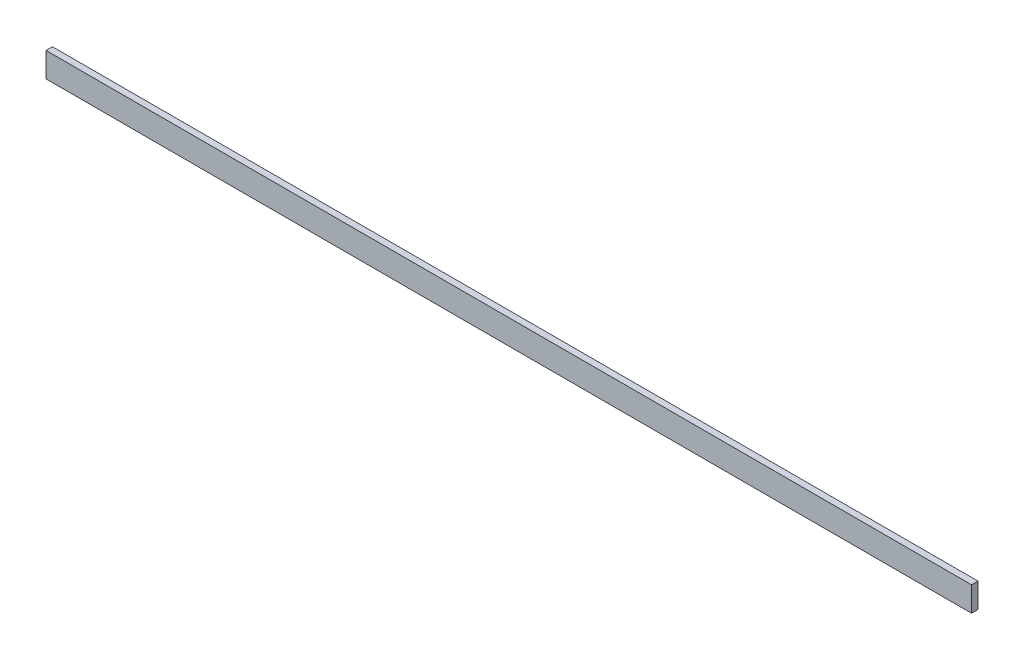
ISO-10303-21;
HEADER;
FILE_DESCRIPTION(('STEP AP214'),'2;1');
FILE_NAME('part.step','',(''),(''),'','','');
FILE_SCHEMA(('AUTOMOTIVE_DESIGN { 1 0 10303 214 1 1 1 1 }'));
ENDSEC;
DATA;
#1=APPLICATION_CONTEXT('core data for automotive mechanical design processes');
#2=APPLICATION_PROTOCOL_DEFINITION('international standard','automotive_design',2000,#1);
#3=PRODUCT_CONTEXT('',#1,'mechanical');
#4=PRODUCT('Part','Part','',(#3));
#5=PRODUCT_RELATED_PRODUCT_CATEGORY('part','',(#4));
#6=PRODUCT_DEFINITION_FORMATION('','',#4);
#7=PRODUCT_DEFINITION_CONTEXT('part definition',#1,'design');
#8=PRODUCT_DEFINITION('design','',#6,#7);
#9=PRODUCT_DEFINITION_SHAPE('','',#8);
#10=(LENGTH_UNIT() NAMED_UNIT(*) SI_UNIT(.MILLI.,.METRE.));
#11=(NAMED_UNIT(*) PLANE_ANGLE_UNIT() SI_UNIT($,.RADIAN.));
#12=(NAMED_UNIT(*) SI_UNIT($,.STERADIAN.) SOLID_ANGLE_UNIT());
#13=UNCERTAINTY_MEASURE_WITH_UNIT(LENGTH_MEASURE(1.E-05),#10,'distance_accuracy_value','');
#14=(GEOMETRIC_REPRESENTATION_CONTEXT(3) GLOBAL_UNCERTAINTY_ASSIGNED_CONTEXT((#13)) GLOBAL_UNIT_ASSIGNED_CONTEXT((#10,
#11,#12)) REPRESENTATION_CONTEXT('',''));
#15=CARTESIAN_POINT('',(0.,0.,0.));
#16=DIRECTION('',(0.,0.,1.));
#17=DIRECTION('',(1.,0.,0.));
#18=AXIS2_PLACEMENT_3D('',#15,#16,#17);
#19=CARTESIAN_POINT('',(0.,38.2926221353073,10.));
#20=DIRECTION('',(1.,0.,0.));
#21=DIRECTION('',(0.,0.,-1.));
#22=AXIS2_PLACEMENT_3D('',#19,#20,#21);
#23=PLANE('',#22);
#24=DIRECTION('',(0.,-1.,0.));
#25=VECTOR('',#24,1.);
#26=CARTESIAN_POINT('',(0.,38.2926221353073,0.));
#27=LINE('',#26,#25);
#28=CARTESIAN_POINT('',(0.,38.2926221353073,0.));
#29=VERTEX_POINT('',#28);
#30=CARTESIAN_POINT('',(0.,0.,0.));
#31=VERTEX_POINT('',#30);
#32=EDGE_CURVE('E113',#29,#31,#27,.T.);
#33=ORIENTED_EDGE('',*,*,#32,.T.);
#34=DIRECTION('',(0.,0.,-1.));
#35=VECTOR('',#34,1.);
#36=CARTESIAN_POINT('',(0.,0.,10.));
#37=LINE('',#36,#35);
#38=CARTESIAN_POINT('',(0.,0.,10.));
#39=VERTEX_POINT('',#38);
#40=EDGE_CURVE('E11',#39,#31,#37,.T.);
#41=ORIENTED_EDGE('',*,*,#40,.F.);
#42=DIRECTION('',(0.,-1.,0.));
#43=VECTOR('',#42,1.);
#44=CARTESIAN_POINT('',(0.,38.2926221353073,10.));
#45=LINE('',#44,#43);
#46=CARTESIAN_POINT('',(0.,38.2926221353073,10.));
#47=VERTEX_POINT('',#46);
#48=EDGE_CURVE('E97',#47,#39,#45,.T.);
#49=ORIENTED_EDGE('',*,*,#48,.F.);
#50=DIRECTION('',(0.,0.,-1.));
#51=VECTOR('',#50,1.);
#52=CARTESIAN_POINT('',(0.,38.2926221353073,10.));
#53=LINE('',#52,#51);
#54=EDGE_CURVE('E109',#47,#29,#53,.T.);
#55=ORIENTED_EDGE('',*,*,#54,.T.);
#56=EDGE_LOOP('',(#33,#41,#49,#55));
#57=FACE_BOUND('',#56,.T.);
#58=ADVANCED_FACE('F45',(#57),#23,.F.);
#59=CARTESIAN_POINT('',(0.,0.,10.));
#60=DIRECTION('',(0.,1.,0.));
#61=DIRECTION('',(0.,0.,1.));
#62=AXIS2_PLACEMENT_3D('',#59,#60,#61);
#63=PLANE('',#62);
#64=DIRECTION('',(1.,0.,0.));
#65=VECTOR('',#64,1.);
#66=CARTESIAN_POINT('',(0.,0.,0.));
#67=LINE('',#66,#65);
#68=CARTESIAN_POINT('',(1437.24975081187,0.,0.));
#69=VERTEX_POINT('',#68);
#70=EDGE_CURVE('E102',#31,#69,#67,.T.);
#71=ORIENTED_EDGE('',*,*,#70,.T.);
#72=DIRECTION('',(0.,0.,-1.));
#73=VECTOR('',#72,1.);
#74=CARTESIAN_POINT('',(1437.24975081187,0.,10.));
#75=LINE('',#74,#73);
#76=CARTESIAN_POINT('',(1437.24975081187,0.,10.));
#77=VERTEX_POINT('',#76);
#78=EDGE_CURVE('E54',#77,#69,#75,.T.);
#79=ORIENTED_EDGE('',*,*,#78,.F.);
#80=DIRECTION('',(1.,0.,0.));
#81=VECTOR('',#80,1.);
#82=CARTESIAN_POINT('',(0.,0.,10.));
#83=LINE('',#82,#81);
#84=EDGE_CURVE('E92',#39,#77,#83,.T.);
#85=ORIENTED_EDGE('',*,*,#84,.F.);
#86=ORIENTED_EDGE('',*,*,#40,.T.);
#87=EDGE_LOOP('',(#71,#79,#85,#86));
#88=FACE_BOUND('',#87,.T.);
#89=ADVANCED_FACE('F101',(#88),#63,.F.);
#90=CARTESIAN_POINT('',(1437.24975081187,0.,10.));
#91=DIRECTION('',(-1.,0.,0.));
#92=DIRECTION('',(0.,0.,1.));
#93=AXIS2_PLACEMENT_3D('',#90,#91,#92);
#94=PLANE('',#93);
#95=DIRECTION('',(0.,1.,0.));
#96=VECTOR('',#95,1.);
#97=CARTESIAN_POINT('',(1437.24975081187,0.,0.));
#98=LINE('',#97,#96);
#99=CARTESIAN_POINT('',(1437.24975081187,38.2926221353073,0.));
#100=VERTEX_POINT('',#99);
#101=EDGE_CURVE('E79',#69,#100,#98,.T.);
#102=ORIENTED_EDGE('',*,*,#101,.T.);
#103=DIRECTION('',(0.,0.,-1.));
#104=VECTOR('',#103,1.);
#105=CARTESIAN_POINT('',(1437.24975081187,38.2926221353073,10.));
#106=LINE('',#105,#104);
#107=CARTESIAN_POINT('',(1437.24975081187,38.2926221353073,10.));
#108=VERTEX_POINT('',#107);
#109=EDGE_CURVE('E104',#108,#100,#106,.T.);
#110=ORIENTED_EDGE('',*,*,#109,.F.);
#111=DIRECTION('',(0.,1.,0.));
#112=VECTOR('',#111,1.);
#113=CARTESIAN_POINT('',(1437.24975081187,0.,10.));
#114=LINE('',#113,#112);
#115=EDGE_CURVE('E95',#77,#108,#114,.T.);
#116=ORIENTED_EDGE('',*,*,#115,.F.);
#117=ORIENTED_EDGE('',*,*,#78,.T.);
#118=EDGE_LOOP('',(#102,#110,#116,#117));
#119=FACE_BOUND('',#118,.T.);
#120=ADVANCED_FACE('F105',(#119),#94,.F.);
#121=CARTESIAN_POINT('',(1437.24975081187,38.2926221353073,10.));
#122=DIRECTION('',(0.,-1.,0.));
#123=DIRECTION('',(0.,0.,-1.));
#124=AXIS2_PLACEMENT_3D('',#121,#122,#123);
#125=PLANE('',#124);
#126=DIRECTION('',(-1.,0.,0.));
#127=VECTOR('',#126,1.);
#128=CARTESIAN_POINT('',(1437.24975081187,38.2926221353073,0.));
#129=LINE('',#128,#127);
#130=EDGE_CURVE('E85',#100,#29,#129,.T.);
#131=ORIENTED_EDGE('',*,*,#130,.T.);
#132=ORIENTED_EDGE('',*,*,#54,.F.);
#133=DIRECTION('',(-1.,0.,0.));
#134=VECTOR('',#133,1.);
#135=CARTESIAN_POINT('',(1437.24975081187,38.2926221353073,10.));
#136=LINE('',#135,#134);
#137=EDGE_CURVE('E62',#108,#47,#136,.T.);
#138=ORIENTED_EDGE('',*,*,#137,.F.);
#139=ORIENTED_EDGE('',*,*,#109,.T.);
#140=EDGE_LOOP('',(#131,#132,#138,#139));
#141=FACE_BOUND('',#140,.T.);
#142=ADVANCED_FACE('F126',(#141),#125,.F.);
#143=CARTESIAN_POINT('',(0.,0.,10.));
#144=DIRECTION('',(0.,0.,1.));
#145=DIRECTION('',(1.,0.,0.));
#146=AXIS2_PLACEMENT_3D('',#143,#144,#145);
#147=PLANE('',#146);
#148=ORIENTED_EDGE('',*,*,#48,.T.);
#149=ORIENTED_EDGE('',*,*,#84,.T.);
#150=ORIENTED_EDGE('',*,*,#115,.T.);
#151=ORIENTED_EDGE('',*,*,#137,.T.);
#152=EDGE_LOOP('',(#148,#149,#150,#151));
#153=FACE_BOUND('',#152,.T.);
#154=ADVANCED_FACE('F93',(#153),#147,.T.);
#155=CARTESIAN_POINT('',(0.,0.,0.));
#156=DIRECTION('',(0.,0.,1.));
#157=DIRECTION('',(1.,0.,0.));
#158=AXIS2_PLACEMENT_3D('',#155,#156,#157);
#159=PLANE('',#158);
#160=ORIENTED_EDGE('',*,*,#32,.F.);
#161=ORIENTED_EDGE('',*,*,#130,.F.);
#162=ORIENTED_EDGE('',*,*,#101,.F.);
#163=ORIENTED_EDGE('',*,*,#70,.F.);
#164=EDGE_LOOP('',(#160,#161,#162,#163));
#165=FACE_BOUND('',#164,.T.);
#166=ADVANCED_FACE('F129',(#165),#159,.F.);
#167=CLOSED_SHELL('',(#58,#89,#120,#142,#154,#166));
#168=MANIFOLD_SOLID_BREP('B2',#167);
#169=ADVANCED_BREP_SHAPE_REPRESENTATION('',(#18,#168),#14);
#170=SHAPE_DEFINITION_REPRESENTATION(#9,#169);
ENDSEC;
END-ISO-10303-21;
